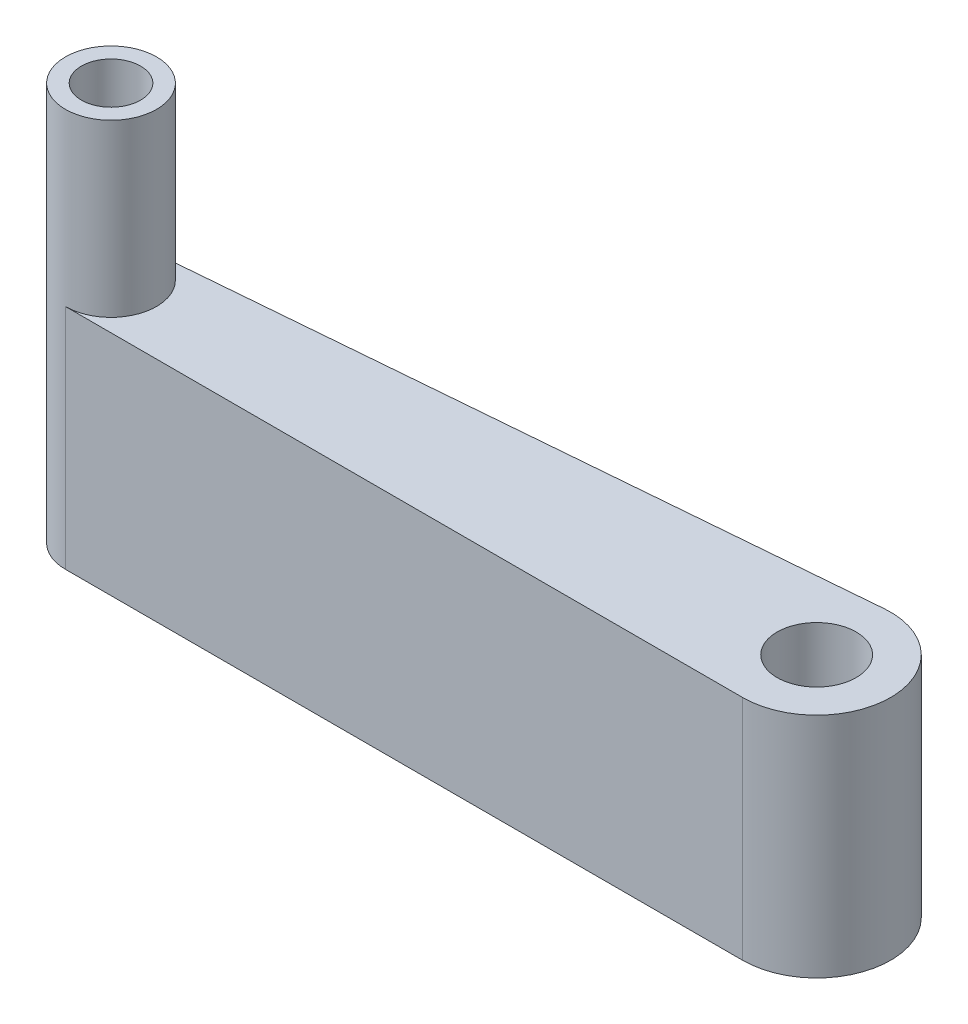
ISO-10303-21;
HEADER;
FILE_DESCRIPTION(('STEP AP214'),'2;1');
FILE_NAME('part.step','',(''),(''),'','','');
FILE_SCHEMA(('AUTOMOTIVE_DESIGN { 1 0 10303 214 1 1 1 1 }'));
ENDSEC;
DATA;
#1=APPLICATION_CONTEXT('core data for automotive mechanical design processes');
#2=APPLICATION_PROTOCOL_DEFINITION('international standard','automotive_design',2000,#1);
#3=PRODUCT_CONTEXT('',#1,'mechanical');
#4=PRODUCT('Part','Part','',(#3));
#5=PRODUCT_RELATED_PRODUCT_CATEGORY('part','',(#4));
#6=PRODUCT_DEFINITION_FORMATION('','',#4);
#7=PRODUCT_DEFINITION_CONTEXT('part definition',#1,'design');
#8=PRODUCT_DEFINITION('design','',#6,#7);
#9=PRODUCT_DEFINITION_SHAPE('','',#8);
#10=(LENGTH_UNIT() NAMED_UNIT(*) SI_UNIT(.MILLI.,.METRE.));
#11=(NAMED_UNIT(*) PLANE_ANGLE_UNIT() SI_UNIT($,.RADIAN.));
#12=(NAMED_UNIT(*) SI_UNIT($,.STERADIAN.) SOLID_ANGLE_UNIT());
#13=UNCERTAINTY_MEASURE_WITH_UNIT(LENGTH_MEASURE(1.E-05),#10,'distance_accuracy_value','');
#14=(GEOMETRIC_REPRESENTATION_CONTEXT(3) GLOBAL_UNCERTAINTY_ASSIGNED_CONTEXT((#13)) GLOBAL_UNIT_ASSIGNED_CONTEXT((#10,
#11,#12)) REPRESENTATION_CONTEXT('',''));
#15=CARTESIAN_POINT('',(0.,0.,0.));
#16=DIRECTION('',(0.,0.,1.));
#17=DIRECTION('',(1.,0.,0.));
#18=AXIS2_PLACEMENT_3D('',#15,#16,#17);
#19=CARTESIAN_POINT('',(0.,10.,0.));
#20=DIRECTION('',(0.,-1.,0.));
#21=DIRECTION('',(0.,0.,1.));
#22=AXIS2_PLACEMENT_3D('',#19,#20,#21);
#23=CYLINDRICAL_SURFACE('',#22,6.5);
#24=CARTESIAN_POINT('',(0.,-10.,0.));
#25=DIRECTION('',(0.,-1.,0.));
#26=DIRECTION('',(0.,0.,-1.));
#27=AXIS2_PLACEMENT_3D('',#24,#25,#26);
#28=CIRCLE('',#27,6.5);
#29=CARTESIAN_POINT('',(-0.545255886084874,-10.,-6.47709008881996));
#30=VERTEX_POINT('',#29);
#31=CARTESIAN_POINT('',(0.,-10.,6.5));
#32=VERTEX_POINT('',#31);
#33=EDGE_CURVE('E101',#30,#32,#28,.T.);
#34=ORIENTED_EDGE('',*,*,#33,.F.);
#35=DIRECTION('',(0.,-1.,0.));
#36=VECTOR('',#35,1.);
#37=CARTESIAN_POINT('',(-0.545255886084874,10.,-6.47709008881996));
#38=LINE('',#37,#36);
#39=CARTESIAN_POINT('',(-0.545255886084874,10.,-6.47709008881996));
#40=VERTEX_POINT('',#39);
#41=EDGE_CURVE('E96',#40,#30,#38,.T.);
#42=ORIENTED_EDGE('',*,*,#41,.F.);
#43=CARTESIAN_POINT('',(0.,10.,0.));
#44=DIRECTION('',(0.,-1.,0.));
#45=DIRECTION('',(0.,0.,-1.));
#46=AXIS2_PLACEMENT_3D('',#43,#44,#45);
#47=CIRCLE('',#46,6.5);
#48=CARTESIAN_POINT('',(0.,10.,6.5));
#49=VERTEX_POINT('',#48);
#50=EDGE_CURVE('E94',#40,#49,#47,.T.);
#51=ORIENTED_EDGE('',*,*,#50,.T.);
#52=DIRECTION('',(0.,-1.,0.));
#53=VECTOR('',#52,1.);
#54=CARTESIAN_POINT('',(0.,10.,6.5));
#55=LINE('',#54,#53);
#56=EDGE_CURVE('E38',#49,#32,#55,.T.);
#57=ORIENTED_EDGE('',*,*,#56,.T.);
#58=EDGE_LOOP('',(#34,#42,#51,#57));
#59=FACE_BOUND('',#58,.T.);
#60=ADVANCED_FACE('F35',(#59),#23,.T.);
#61=CARTESIAN_POINT('',(-59.5,10.,6.5));
#62=DIRECTION('',(0.,0.,-1.));
#63=DIRECTION('',(1.,0.,0.));
#64=AXIS2_PLACEMENT_3D('',#61,#62,#63);
#65=PLANE('',#64);
#66=DIRECTION('',(-1.,0.,0.));
#67=VECTOR('',#66,1.);
#68=CARTESIAN_POINT('',(-59.5,-10.,6.5));
#69=LINE('',#68,#67);
#70=CARTESIAN_POINT('',(-59.5,-10.,6.5));
#71=VERTEX_POINT('',#70);
#72=EDGE_CURVE('E103',#32,#71,#69,.T.);
#73=ORIENTED_EDGE('',*,*,#72,.F.);
#74=ORIENTED_EDGE('',*,*,#56,.F.);
#75=DIRECTION('',(-1.,0.,0.));
#76=VECTOR('',#75,1.);
#77=CARTESIAN_POINT('',(-59.5,10.,6.5));
#78=LINE('',#77,#76);
#79=CARTESIAN_POINT('',(-59.5,10.,6.50000000000001));
#80=VERTEX_POINT('',#79);
#81=EDGE_CURVE('E75',#49,#80,#78,.T.);
#82=ORIENTED_EDGE('',*,*,#81,.T.);
#83=DIRECTION('',(0.,-1.,0.));
#84=VECTOR('',#83,1.);
#85=CARTESIAN_POINT('',(-59.5,10.,6.5));
#86=LINE('',#85,#84);
#87=EDGE_CURVE('E84',#80,#71,#86,.T.);
#88=ORIENTED_EDGE('',*,*,#87,.T.);
#89=EDGE_LOOP('',(#73,#74,#82,#88));
#90=FACE_BOUND('',#89,.T.);
#91=ADVANCED_FACE('F91',(#90),#65,.F.);
#92=CARTESIAN_POINT('',(-59.5,10.,2.5));
#93=DIRECTION('',(0.,-1.,0.));
#94=DIRECTION('',(0.,0.,1.));
#95=AXIS2_PLACEMENT_3D('',#92,#93,#94);
#96=CYLINDRICAL_SURFACE('',#95,4.);
#97=CARTESIAN_POINT('',(-59.5,-10.,2.5));
#98=DIRECTION('',(0.,-1.,0.));
#99=DIRECTION('',(0.,0.,-1.));
#100=AXIS2_PLACEMENT_3D('',#97,#98,#99);
#101=CIRCLE('',#100,4.);
#102=CARTESIAN_POINT('',(-59.8355420837445,-10.,-1.48590159311998));
#103=VERTEX_POINT('',#102);
#104=EDGE_CURVE('E87',#71,#103,#101,.T.);
#105=ORIENTED_EDGE('',*,*,#104,.F.);
#106=ORIENTED_EDGE('',*,*,#87,.F.);
#107=CARTESIAN_POINT('',(-59.5,10.,2.5));
#108=DIRECTION('',(0.,-1.,0.));
#109=DIRECTION('',(0.,0.,-1.));
#110=AXIS2_PLACEMENT_3D('',#107,#108,#109);
#111=CIRCLE('',#110,4.00000000000001);
#112=CARTESIAN_POINT('',(-59.8355420837445,10.,-1.48590159311998));
#113=VERTEX_POINT('',#112);
#114=EDGE_CURVE('E11',#113,#80,#111,.T.);
#115=ORIENTED_EDGE('',*,*,#114,.F.);
#116=DIRECTION('',(0.,-1.,0.));
#117=VECTOR('',#116,1.);
#118=CARTESIAN_POINT('',(-59.8355420837445,10.,-1.48590159311998));
#119=LINE('',#118,#117);
#120=EDGE_CURVE('E90',#113,#103,#119,.T.);
#121=ORIENTED_EDGE('',*,*,#120,.T.);
#122=EDGE_LOOP('',(#105,#106,#115,#121));
#123=FACE_BOUND('',#122,.T.);
#124=CARTESIAN_POINT('',(-59.5,25.,2.5));
#125=DIRECTION('',(0.,-1.,0.));
#126=DIRECTION('',(0.,0.,-1.));
#127=AXIS2_PLACEMENT_3D('',#124,#125,#126);
#128=CIRCLE('',#127,4.00000000000001);
#129=CARTESIAN_POINT('',(-59.5,25.,-1.50000000000001));
#130=VERTEX_POINT('',#129);
#131=EDGE_CURVE('E199',#130,#130,#128,.T.);
#132=ORIENTED_EDGE('',*,*,#131,.T.);
#133=EDGE_LOOP('',(#132));
#134=FACE_BOUND('',#133,.T.);
#135=ADVANCED_FACE('F85',(#123,#134),#96,.T.);
#136=CARTESIAN_POINT('',(-59.8355420837445,10.,-1.48590159311998));
#137=DIRECTION('',(0.0838855209361342,0.,0.996475398279994));
#138=DIRECTION('',(-0.996475398279994,0.,0.0838855209361342));
#139=AXIS2_PLACEMENT_3D('',#136,#137,#138);
#140=PLANE('',#139);
#141=DIRECTION('',(0.996475398279995,0.,-0.0838855209361342));
#142=VECTOR('',#141,1.);
#143=CARTESIAN_POINT('',(-59.8355420837445,-10.,-1.48590159311998));
#144=LINE('',#143,#142);
#145=EDGE_CURVE('E67',#103,#30,#144,.T.);
#146=ORIENTED_EDGE('',*,*,#145,.F.);
#147=ORIENTED_EDGE('',*,*,#120,.F.);
#148=DIRECTION('',(0.996475398279995,0.,-0.0838855209361342));
#149=VECTOR('',#148,1.);
#150=CARTESIAN_POINT('',(-59.8355420837445,10.,-1.48590159311998));
#151=LINE('',#150,#149);
#152=EDGE_CURVE('E52',#113,#40,#151,.T.);
#153=ORIENTED_EDGE('',*,*,#152,.T.);
#154=ORIENTED_EDGE('',*,*,#41,.T.);
#155=EDGE_LOOP('',(#146,#147,#153,#154));
#156=FACE_BOUND('',#155,.T.);
#157=ADVANCED_FACE('F113',(#156),#140,.F.);
#158=CARTESIAN_POINT('',(0.,10.,0.));
#159=DIRECTION('',(0.,1.,0.));
#160=DIRECTION('',(0.,0.,-1.));
#161=AXIS2_PLACEMENT_3D('',#158,#159,#160);
#162=PLANE('',#161);
#163=ORIENTED_EDGE('',*,*,#114,.T.);
#164=ORIENTED_EDGE('',*,*,#81,.F.);
#165=ORIENTED_EDGE('',*,*,#50,.F.);
#166=ORIENTED_EDGE('',*,*,#152,.F.);
#167=EDGE_LOOP('',(#163,#164,#165,#166));
#168=FACE_BOUND('',#167,.T.);
#169=CARTESIAN_POINT('',(0.,10.,0.));
#170=DIRECTION('',(0.,-1.,0.));
#171=DIRECTION('',(0.,0.,-1.));
#172=AXIS2_PLACEMENT_3D('',#169,#170,#171);
#173=CIRCLE('',#172,3.475);
#174=CARTESIAN_POINT('',(0.,10.,-3.475));
#175=VERTEX_POINT('',#174);
#176=EDGE_CURVE('E203',#175,#175,#173,.T.);
#177=ORIENTED_EDGE('',*,*,#176,.T.);
#178=EDGE_LOOP('',(#177));
#179=FACE_BOUND('',#178,.T.);
#180=ADVANCED_FACE('F80',(#168,#179),#162,.T.);
#181=CARTESIAN_POINT('',(0.,-10.,0.));
#182=DIRECTION('',(0.,1.,0.));
#183=DIRECTION('',(0.,0.,-1.));
#184=AXIS2_PLACEMENT_3D('',#181,#182,#183);
#185=PLANE('',#184);
#186=CARTESIAN_POINT('',(0.,-10.,0.));
#187=DIRECTION('',(0.,-1.,0.));
#188=DIRECTION('',(0.,0.,-1.));
#189=AXIS2_PLACEMENT_3D('',#186,#187,#188);
#190=CIRCLE('',#189,3.475);
#191=CARTESIAN_POINT('',(0.,-10.,-3.475));
#192=VERTEX_POINT('',#191);
#193=EDGE_CURVE('E104',#192,#192,#190,.T.);
#194=ORIENTED_EDGE('',*,*,#193,.F.);
#195=EDGE_LOOP('',(#194));
#196=FACE_BOUND('',#195,.T.);
#197=ORIENTED_EDGE('',*,*,#33,.T.);
#198=ORIENTED_EDGE('',*,*,#72,.T.);
#199=ORIENTED_EDGE('',*,*,#104,.T.);
#200=ORIENTED_EDGE('',*,*,#145,.T.);
#201=EDGE_LOOP('',(#197,#198,#199,#200));
#202=FACE_BOUND('',#201,.T.);
#203=ADVANCED_FACE('F109',(#196,#202),#185,.F.);
#204=CARTESIAN_POINT('',(0.,-10.,0.));
#205=DIRECTION('',(0.,1.,0.));
#206=DIRECTION('',(0.,0.,-1.));
#207=AXIS2_PLACEMENT_3D('',#204,#205,#206);
#208=CYLINDRICAL_SURFACE('',#207,3.475);
#209=ORIENTED_EDGE('',*,*,#193,.T.);
#210=EDGE_LOOP('',(#209));
#211=FACE_BOUND('',#210,.T.);
#212=ORIENTED_EDGE('',*,*,#176,.F.);
#213=EDGE_LOOP('',(#212));
#214=FACE_BOUND('',#213,.T.);
#215=ADVANCED_FACE('F153',(#211,#214),#208,.F.);
#216=CARTESIAN_POINT('',(-59.5,25.,2.5));
#217=DIRECTION('',(0.,1.,0.));
#218=DIRECTION('',(0.,0.,-1.));
#219=AXIS2_PLACEMENT_3D('',#216,#217,#218);
#220=PLANE('',#219);
#221=CARTESIAN_POINT('',(-59.5,25.,2.5));
#222=DIRECTION('',(0.,-1.,0.));
#223=DIRECTION('',(0.,0.,-1.));
#224=AXIS2_PLACEMENT_3D('',#221,#222,#223);
#225=CIRCLE('',#224,2.6);
#226=CARTESIAN_POINT('',(-59.5,25.,-0.0999999999999977));
#227=VERTEX_POINT('',#226);
#228=EDGE_CURVE('E200',#227,#227,#225,.T.);
#229=ORIENTED_EDGE('',*,*,#228,.T.);
#230=EDGE_LOOP('',(#229));
#231=FACE_BOUND('',#230,.T.);
#232=ORIENTED_EDGE('',*,*,#131,.F.);
#233=EDGE_LOOP('',(#232));
#234=FACE_BOUND('',#233,.T.);
#235=ADVANCED_FACE('F162',(#231,#234),#220,.T.);
#236=CARTESIAN_POINT('',(-59.5,19.,2.5));
#237=DIRECTION('',(0.,1.,0.));
#238=DIRECTION('',(0.,0.,-1.));
#239=AXIS2_PLACEMENT_3D('',#236,#237,#238);
#240=CYLINDRICAL_SURFACE('',#239,2.6);
#241=CARTESIAN_POINT('',(-59.5,19.,2.5));
#242=DIRECTION('',(0.,-1.,0.));
#243=DIRECTION('',(0.,0.,-1.));
#244=AXIS2_PLACEMENT_3D('',#241,#242,#243);
#245=CIRCLE('',#244,2.6);
#246=CARTESIAN_POINT('',(-59.5,19.,-0.0999999999999977));
#247=VERTEX_POINT('',#246);
#248=EDGE_CURVE('E198',#247,#247,#245,.T.);
#249=ORIENTED_EDGE('',*,*,#248,.T.);
#250=EDGE_LOOP('',(#249));
#251=FACE_BOUND('',#250,.T.);
#252=ORIENTED_EDGE('',*,*,#228,.F.);
#253=EDGE_LOOP('',(#252));
#254=FACE_BOUND('',#253,.T.);
#255=ADVANCED_FACE('F172',(#251,#254),#240,.F.);
#256=CARTESIAN_POINT('',(-59.5,19.,2.5));
#257=DIRECTION('',(0.,1.,0.));
#258=DIRECTION('',(0.,0.,-1.));
#259=AXIS2_PLACEMENT_3D('',#256,#257,#258);
#260=PLANE('',#259);
#261=ORIENTED_EDGE('',*,*,#248,.F.);
#262=EDGE_LOOP('',(#261));
#263=FACE_BOUND('',#262,.T.);
#264=ADVANCED_FACE('F182',(#263),#260,.T.);
#265=CLOSED_SHELL('',(#60,#91,#135,#157,#180,#203,#215,#235,#255,#264));
#266=MANIFOLD_SOLID_BREP('B2',#265);
#267=ADVANCED_BREP_SHAPE_REPRESENTATION('',(#18,#266),#14);
#268=SHAPE_DEFINITION_REPRESENTATION(#9,#267);
ENDSEC;
END-ISO-10303-21;
